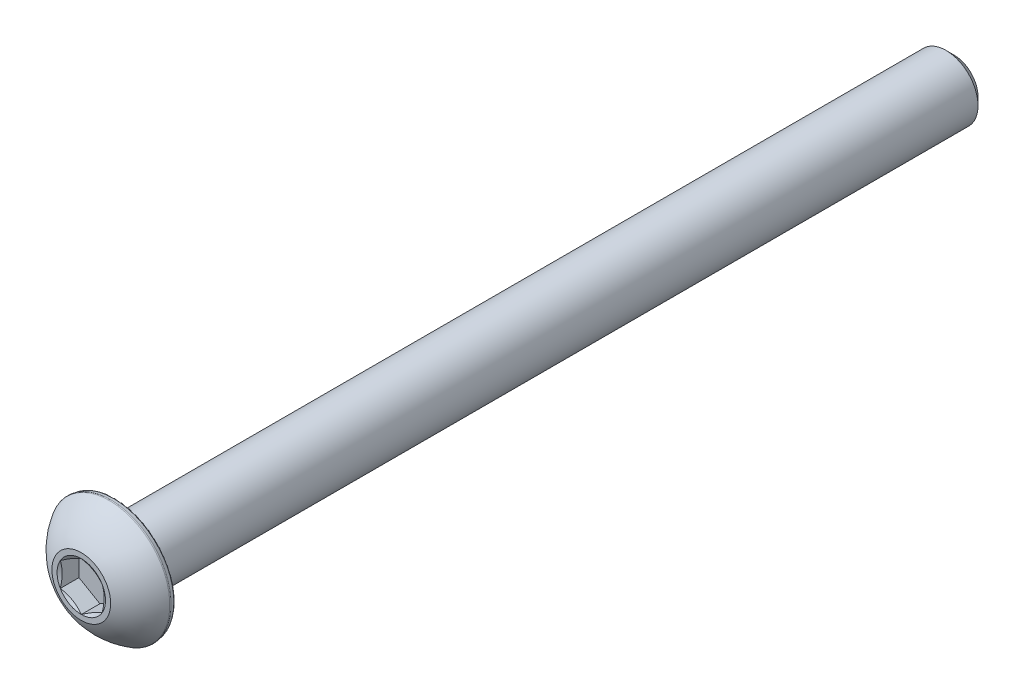
ISO-10303-21;
HEADER;
FILE_DESCRIPTION(('STEP AP214'),'2;1');
FILE_NAME('part.step','',(''),(''),'','','');
FILE_SCHEMA(('AUTOMOTIVE_DESIGN { 1 0 10303 214 1 1 1 1 }'));
ENDSEC;
DATA;
#1=APPLICATION_CONTEXT('core data for automotive mechanical design processes');
#2=APPLICATION_PROTOCOL_DEFINITION('international standard','automotive_design',2000,#1);
#3=PRODUCT_CONTEXT('',#1,'mechanical');
#4=PRODUCT('Part','Part','',(#3));
#5=PRODUCT_RELATED_PRODUCT_CATEGORY('part','',(#4));
#6=PRODUCT_DEFINITION_FORMATION('','',#4);
#7=PRODUCT_DEFINITION_CONTEXT('part definition',#1,'design');
#8=PRODUCT_DEFINITION('design','',#6,#7);
#9=PRODUCT_DEFINITION_SHAPE('','',#8);
#10=(LENGTH_UNIT() NAMED_UNIT(*) SI_UNIT(.MILLI.,.METRE.));
#11=(NAMED_UNIT(*) PLANE_ANGLE_UNIT() SI_UNIT($,.RADIAN.));
#12=(NAMED_UNIT(*) SI_UNIT($,.STERADIAN.) SOLID_ANGLE_UNIT());
#13=UNCERTAINTY_MEASURE_WITH_UNIT(LENGTH_MEASURE(1.E-05),#10,'distance_accuracy_value','');
#14=(GEOMETRIC_REPRESENTATION_CONTEXT(3) GLOBAL_UNCERTAINTY_ASSIGNED_CONTEXT((#13)) GLOBAL_UNIT_ASSIGNED_CONTEXT((#10,
#11,#12)) REPRESENTATION_CONTEXT('',''));
#15=CARTESIAN_POINT('',(0.,0.,0.));
#16=DIRECTION('',(0.,0.,1.));
#17=DIRECTION('',(1.,0.,0.));
#18=AXIS2_PLACEMENT_3D('',#15,#16,#17);
#19=CARTESIAN_POINT('',(0.,0.,33.0327));
#20=DIRECTION('',(0.,0.,-1.));
#21=DIRECTION('',(-1.,0.,0.));
#22=AXIS2_PLACEMENT_3D('',#19,#20,#21);
#23=PLANE('',#22);
#24=CARTESIAN_POINT('',(0.,0.,33.0327));
#25=DIRECTION('',(0.,0.,1.));
#26=DIRECTION('',(1.,0.,0.));
#27=AXIS2_PLACEMENT_3D('',#24,#25,#26);
#28=CIRCLE('',#27,1.83308710467706);
#29=CARTESIAN_POINT('',(-1.5875,0.916543552338533,33.0327));
#30=VERTEX_POINT('',#29);
#31=CARTESIAN_POINT('',(-1.58750000000001,-0.916543552338526,33.0327));
#32=VERTEX_POINT('',#31);
#33=EDGE_CURVE('E87',#30,#32,#28,.T.);
#34=ORIENTED_EDGE('',*,*,#33,.F.);
#35=CARTESIAN_POINT('',(0.,1.83308710467706,33.0327));
#36=VERTEX_POINT('',#35);
#37=EDGE_CURVE('E96',#36,#30,#28,.T.);
#38=ORIENTED_EDGE('',*,*,#37,.F.);
#39=CARTESIAN_POINT('',(1.5875,0.916543552338534,33.0327));
#40=VERTEX_POINT('',#39);
#41=EDGE_CURVE('E47',#40,#36,#28,.T.);
#42=ORIENTED_EDGE('',*,*,#41,.F.);
#43=CARTESIAN_POINT('',(1.58750000000001,-0.916543552338526,33.0327));
#44=VERTEX_POINT('',#43);
#45=EDGE_CURVE('E54',#44,#40,#28,.T.);
#46=ORIENTED_EDGE('',*,*,#45,.F.);
#47=CARTESIAN_POINT('',(0.,-1.83308710467706,33.0327));
#48=VERTEX_POINT('',#47);
#49=EDGE_CURVE('E129',#48,#44,#28,.T.);
#50=ORIENTED_EDGE('',*,*,#49,.F.);
#51=EDGE_CURVE('E97',#32,#48,#28,.T.);
#52=ORIENTED_EDGE('',*,*,#51,.F.);
#53=EDGE_LOOP('',(#34,#38,#42,#46,#50,#52));
#54=FACE_BOUND('',#53,.T.);
#55=CARTESIAN_POINT('',(0.,0.,33.0327));
#56=DIRECTION('',(0.,0.,1.));
#57=DIRECTION('',(1.,0.,0.));
#58=AXIS2_PLACEMENT_3D('',#55,#56,#57);
#59=CIRCLE('',#58,2.2225);
#60=CARTESIAN_POINT('',(2.2225,0.,33.0327));
#61=VERTEX_POINT('',#60);
#62=EDGE_CURVE('E108',#61,#61,#59,.T.);
#63=ORIENTED_EDGE('',*,*,#62,.T.);
#64=EDGE_LOOP('',(#63));
#65=FACE_BOUND('',#64,.T.);
#66=ADVANCED_FACE('F33',(#54,#65),#23,.F.);
#67=CARTESIAN_POINT('',(0.,0.,28.2553368578917));
#68=DIRECTION('',(0.,0.,1.));
#69=DIRECTION('',(0.,1.,0.));
#70=AXIS2_PLACEMENT_3D('',#67,#68,#69);
#71=SPHERICAL_SURFACE('',#70,5.26903262863073);
#72=CARTESIAN_POINT('',(0.,0.,30.8928886545515));
#73=DIRECTION('',(0.,0.,-1.));
#74=DIRECTION('',(-1.,0.,0.));
#75=AXIS2_PLACEMENT_3D('',#72,#73,#74);
#76=CIRCLE('',#75,4.56136222651872);
#77=CARTESIAN_POINT('',(-4.56136222651872,0.,30.8928886545515));
#78=VERTEX_POINT('',#77);
#79=EDGE_CURVE('E107',#78,#78,#76,.F.);
#80=ORIENTED_EDGE('',*,*,#79,.T.);
#81=EDGE_LOOP('',(#80));
#82=FACE_BOUND('',#81,.T.);
#83=ORIENTED_EDGE('',*,*,#62,.F.);
#84=EDGE_LOOP('',(#83));
#85=FACE_BOUND('',#84,.T.);
#86=ADVANCED_FACE('F202',(#82,#85),#71,.T.);
#87=CARTESIAN_POINT('',(0.,0.,30.4673));
#88=DIRECTION('',(0.,0.,1.));
#89=DIRECTION('',(1.,0.,0.));
#90=AXIS2_PLACEMENT_3D('',#87,#88,#89);
#91=CONICAL_SURFACE('',#90,4.51684761455358,0.174532925199433);
#92=CARTESIAN_POINT('',(0.,0.,30.8064059066341));
#93=DIRECTION('',(0.,0.,-1.));
#94=DIRECTION('',(-1.,0.,0.));
#95=AXIS2_PLACEMENT_3D('',#92,#93,#94);
#96=CIRCLE('',#95,4.57664113521079);
#97=CARTESIAN_POINT('',(-4.57664113521079,0.,30.8064059066341));
#98=VERTEX_POINT('',#97);
#99=EDGE_CURVE('E41',#98,#98,#96,.T.);
#100=ORIENTED_EDGE('',*,*,#99,.T.);
#101=EDGE_LOOP('',(#100));
#102=FACE_BOUND('',#101,.T.);
#103=CARTESIAN_POINT('',(0.,0.,30.5732961482507));
#104=DIRECTION('',(0.,0.,-1.));
#105=DIRECTION('',(-1.,0.,0.));
#106=AXIS2_PLACEMENT_3D('',#103,#104,#105);
#107=CIRCLE('',#106,4.53553759534135);
#108=CARTESIAN_POINT('',(-4.53553759534135,0.,30.5732961482507));
#109=VERTEX_POINT('',#108);
#110=EDGE_CURVE('E224',#109,#109,#107,.F.);
#111=ORIENTED_EDGE('',*,*,#110,.T.);
#112=EDGE_LOOP('',(#111));
#113=FACE_BOUND('',#112,.T.);
#114=ADVANCED_FACE('F207',(#102,#113),#91,.T.);
#115=CARTESIAN_POINT('',(0.,4.51684761455358,30.4673));
#116=DIRECTION('',(0.,0.,1.));
#117=DIRECTION('',(1.,0.,0.));
#118=AXIS2_PLACEMENT_3D('',#115,#116,#117);
#119=PLANE('',#118);
#120=CARTESIAN_POINT('',(0.,0.,30.4673));
#121=DIRECTION('',(0.,0.,1.));
#122=DIRECTION('',(1.,0.,0.));
#123=AXIS2_PLACEMENT_3D('',#120,#121,#122);
#124=CIRCLE('',#123,4.40921630486247);
#125=CARTESIAN_POINT('',(4.40921630486247,0.,30.4673));
#126=VERTEX_POINT('',#125);
#127=EDGE_CURVE('E11',#126,#126,#124,.F.);
#128=ORIENTED_EDGE('',*,*,#127,.T.);
#129=EDGE_LOOP('',(#128));
#130=FACE_BOUND('',#129,.T.);
#131=CARTESIAN_POINT('',(0.,0.,30.4673));
#132=DIRECTION('',(0.,0.,1.));
#133=DIRECTION('',(1.,0.,0.));
#134=AXIS2_PLACEMENT_3D('',#131,#132,#133);
#135=CIRCLE('',#134,2.41300000000001);
#136=CARTESIAN_POINT('',(2.41300000000001,0.,30.4673));
#137=VERTEX_POINT('',#136);
#138=EDGE_CURVE('E289',#137,#137,#135,.T.);
#139=ORIENTED_EDGE('',*,*,#138,.T.);
#140=EDGE_LOOP('',(#139));
#141=FACE_BOUND('',#140,.T.);
#142=ADVANCED_FACE('F230',(#130,#141),#119,.F.);
#143=CARTESIAN_POINT('',(0.,0.,33.0327));
#144=DIRECTION('',(0.,0.,1.));
#145=DIRECTION('',(1.,0.,0.));
#146=AXIS2_PLACEMENT_3D('',#143,#144,#145);
#147=CYLINDRICAL_SURFACE('',#146,2.41300000000001);
#148=ORIENTED_EDGE('',*,*,#138,.F.);
#149=EDGE_LOOP('',(#148));
#150=FACE_BOUND('',#149,.T.);
#151=CARTESIAN_POINT('',(0.,0.,-32.4373875));
#152=DIRECTION('',(0.,0.,1.));
#153=DIRECTION('',(1.,0.,0.));
#154=AXIS2_PLACEMENT_3D('',#151,#152,#153);
#155=CIRCLE('',#154,2.41300000000001);
#156=CARTESIAN_POINT('',(2.41300000000001,0.,-32.4373875));
#157=VERTEX_POINT('',#156);
#158=EDGE_CURVE('E286',#157,#157,#155,.T.);
#159=ORIENTED_EDGE('',*,*,#158,.T.);
#160=EDGE_LOOP('',(#159));
#161=FACE_BOUND('',#160,.T.);
#162=ADVANCED_FACE('F236',(#150,#161),#147,.T.);
#163=CARTESIAN_POINT('',(0.,0.,-33.0327));
#164=DIRECTION('',(0.,0.,1.));
#165=DIRECTION('',(1.,0.,0.));
#166=AXIS2_PLACEMENT_3D('',#163,#164,#165);
#167=CONICAL_SURFACE('',#166,1.81768750000001,0.785398163397448);
#168=ORIENTED_EDGE('',*,*,#158,.F.);
#169=EDGE_LOOP('',(#168));
#170=FACE_BOUND('',#169,.T.);
#171=CARTESIAN_POINT('',(0.,0.,-33.0327));
#172=DIRECTION('',(0.,0.,1.));
#173=DIRECTION('',(1.,0.,0.));
#174=AXIS2_PLACEMENT_3D('',#171,#172,#173);
#175=CIRCLE('',#174,1.81768750000001);
#176=CARTESIAN_POINT('',(1.81768750000001,0.,-33.0327));
#177=VERTEX_POINT('',#176);
#178=EDGE_CURVE('E274',#177,#177,#175,.T.);
#179=ORIENTED_EDGE('',*,*,#178,.T.);
#180=EDGE_LOOP('',(#179));
#181=FACE_BOUND('',#180,.T.);
#182=ADVANCED_FACE('F242',(#170,#181),#167,.T.);
#183=CARTESIAN_POINT('',(0.,0.,-33.0327));
#184=DIRECTION('',(0.,0.,1.));
#185=DIRECTION('',(1.,0.,0.));
#186=AXIS2_PLACEMENT_3D('',#183,#184,#185);
#187=PLANE('',#186);
#188=ORIENTED_EDGE('',*,*,#178,.F.);
#189=EDGE_LOOP('',(#188));
#190=FACE_BOUND('',#189,.T.);
#191=ADVANCED_FACE('F246',(#190),#187,.F.);
#192=CARTESIAN_POINT('',(0.,0.,33.0327));
#193=DIRECTION('',(0.,0.,1.));
#194=DIRECTION('',(1.,0.,0.));
#195=AXIS2_PLACEMENT_3D('',#192,#193,#194);
#196=CONICAL_SURFACE('',#195,1.83308710467706,1.0471975511966);
#197=ORIENTED_EDGE('',*,*,#51,.T.);
#198=CARTESIAN_POINT('',(-1.5877,-0.916428082284691,33.0327666729655));
#199=CARTESIAN_POINT('',(-1.51793561383713,-0.956706569415674,33.0095007862806));
#200=CARTESIAN_POINT('',(-1.44756902994941,-0.9973327355652,32.9883408437113));
#201=CARTESIAN_POINT('',(-1.30561723674211,-1.07928864158539,32.9514048800314));
#202=CARTESIAN_POINT('',(-1.23402950399672,-1.12061983835661,32.9356419273586));
#203=CARTESIAN_POINT('',(-1.09174129077364,-1.20276997656347,32.9111031289101));
#204=CARTESIAN_POINT('',(-1.02106271077293,-1.24357627375282,32.9021639893176));
#205=CARTESIAN_POINT('',(-0.879372761498721,-1.32538100410775,32.8914899780298));
#206=CARTESIAN_POINT('',(-0.808361907681014,-1.36637913967479,32.8897462700179));
#207=CARTESIAN_POINT('',(-0.675659384402059,-1.44299497721203,32.8933620228114));
#208=CARTESIAN_POINT('',(-0.6139479110751,-1.47862411294944,32.8978336901089));
#209=CARTESIAN_POINT('',(-0.490927039356861,-1.54965024635191,32.9120099071037));
#210=CARTESIAN_POINT('',(-0.429618066887653,-1.58504699811075,32.9217193055413));
#211=CARTESIAN_POINT('',(-0.306343280023913,-1.65621972949082,32.9459934889126));
#212=CARTESIAN_POINT('',(-0.244393078468155,-1.69198669503539,32.9606612337072));
#213=CARTESIAN_POINT('',(-0.121416971719016,-1.7629869833709,32.9939517983435));
#214=CARTESIAN_POINT('',(-0.0603894894127828,-1.79822121670836,33.0125667893901));
#215=CARTESIAN_POINT('',(0.000200000000000892,-1.8332025747309,33.0327666729655));
#216=B_SPLINE_CURVE_WITH_KNOTS('',3,(#198,#199,#200,#201,#202,#203,#204,#205,#206,#207,#208,
#209,#210,#211,#212,#213,#214,#215),.UNSPECIFIED.,.F.,.F.,(4,2,2,2,2,2,2,2,4),(0.,
0.251647272601205,0.503899652171033,0.749908024753695,0.995614197816256,1.20960574360963,
1.42379572923035,1.64273857632786,1.86125117688001),.UNSPECIFIED.);
#217=EDGE_CURVE('E102',#32,#48,#216,.T.);
#218=ORIENTED_EDGE('',*,*,#217,.F.);
#219=EDGE_LOOP('',(#197,#218));
#220=FACE_BOUND('',#219,.T.);
#221=ADVANCED_FACE('F103',(#220),#196,.F.);
#222=ORIENTED_EDGE('',*,*,#49,.T.);
#223=CARTESIAN_POINT('',(-0.000199999999999989,-1.8332025747309,33.0327666729655));
#224=CARTESIAN_POINT('',(0.0695643861628727,-1.79292408759991,33.0095007862806));
#225=CARTESIAN_POINT('',(0.139930970050586,-1.75229792145039,32.9883408437113));
#226=CARTESIAN_POINT('',(0.281882763257892,-1.6703420154302,32.9514048800314));
#227=CARTESIAN_POINT('',(0.353470496003282,-1.62901081865897,32.9356419273586));
#228=CARTESIAN_POINT('',(0.495758709226359,-1.54686068045212,32.9111031289101));
#229=CARTESIAN_POINT('',(0.566437289227069,-1.50605438326277,32.9021639893176));
#230=CARTESIAN_POINT('',(0.708127238501278,-1.42424965290784,32.8914899780298));
#231=CARTESIAN_POINT('',(0.779138092318984,-1.3832515173408,32.8897462700179));
#232=CARTESIAN_POINT('',(0.911840615597939,-1.30663567980355,32.8933620228114));
#233=CARTESIAN_POINT('',(0.973552088924898,-1.27100654406615,32.8978336901089));
#234=CARTESIAN_POINT('',(1.09657296064314,-1.19998041066368,32.9120099071037));
#235=CARTESIAN_POINT('',(1.15788193311235,-1.16458365890484,32.9217193055413));
#236=CARTESIAN_POINT('',(1.28115671997609,-1.09341092752477,32.9459934889126));
#237=CARTESIAN_POINT('',(1.34310692153184,-1.0576439619802,32.9606612337072));
#238=CARTESIAN_POINT('',(1.46608302828098,-0.986643673644692,32.9939517983435));
#239=CARTESIAN_POINT('',(1.52711051058722,-0.951409440307223,33.0125667893901));
#240=CARTESIAN_POINT('',(1.5877,-0.91642808228469,33.0327666729655));
#241=B_SPLINE_CURVE_WITH_KNOTS('',3,(#223,#224,#225,#226,#227,#228,#229,#230,#231,#232,#233,
#234,#235,#236,#237,#238,#239,#240),.UNSPECIFIED.,.F.,.F.,(4,2,2,2,2,2,2,2,4),(0.,
0.251647272601204,0.503899652171032,0.749908024753693,0.995614197816254,1.20960574360963,
1.42379572923035,1.64273857632785,1.86125117688),.UNSPECIFIED.);
#242=EDGE_CURVE('E131',#48,#44,#241,.T.);
#243=ORIENTED_EDGE('',*,*,#242,.F.);
#244=EDGE_LOOP('',(#222,#243));
#245=FACE_BOUND('',#244,.T.);
#246=ADVANCED_FACE('F315',(#245),#196,.F.);
#247=ORIENTED_EDGE('',*,*,#45,.T.);
#248=CARTESIAN_POINT('',(1.5875,-2.37354288027605,33.6229885208739));
#249=CARTESIAN_POINT('',(1.5875,-2.30498906897406,33.5900989849401));
#250=CARTESIAN_POINT('',(1.5875,-2.23626839223786,33.5575511500262));
#251=CARTESIAN_POINT('',(1.5875,-2.09840401641783,33.4933325063193));
#252=CARTESIAN_POINT('',(1.5875,-2.02926024390265,33.4616618553611));
#253=CARTESIAN_POINT('',(1.5875,-1.89006393379529,33.3992142743397));
#254=CARTESIAN_POINT('',(1.5875,-1.82000842787054,33.3684439309972));
#255=CARTESIAN_POINT('',(1.5875,-1.6793106951035,33.3082837403263));
#256=CARTESIAN_POINT('',(1.5875,-1.60866849899343,33.278893821218));
#257=CARTESIAN_POINT('',(1.5875,-1.46481905678083,33.2211103594079));
#258=CARTESIAN_POINT('',(1.5875,-1.39159303106009,33.1927629463599));
#259=CARTESIAN_POINT('',(1.5875,-1.24427117679401,33.1384344562192));
#260=CARTESIAN_POINT('',(1.5875,-1.17017524056602,33.1124536756443));
#261=CARTESIAN_POINT('',(1.5875,-0.946703117236296,33.0391569820684));
#262=CARTESIAN_POINT('',(1.5875,-0.795733661821906,32.9963147731057));
#263=CARTESIAN_POINT('',(1.5875,-0.566258816268268,32.9466199166704));
#264=CARTESIAN_POINT('',(1.5875,-0.489336969230921,32.9324894569834));
#265=CARTESIAN_POINT('',(1.5875,-0.334627971891012,32.9100533723758));
#266=CARTESIAN_POINT('',(1.5875,-0.256840880424314,32.9017473538284));
#267=CARTESIAN_POINT('',(1.5875,-0.101768207486038,32.8917284519227));
#268=CARTESIAN_POINT('',(1.5875,-0.0244877840878056,32.8899377648977));
#269=CARTESIAN_POINT('',(1.5875,0.129945425556553,32.892893558617));
#270=CARTESIAN_POINT('',(1.5875,0.207098203603202,32.8976404441443));
#271=CARTESIAN_POINT('',(1.5875,0.397461231176442,32.9170004956614));
#272=CARTESIAN_POINT('',(1.5875,0.510302581730163,32.9352417856813));
#273=CARTESIAN_POINT('',(1.5875,0.733790948294141,32.9822808093857));
#274=CARTESIAN_POINT('',(1.5875,0.844435149473764,33.0110912661176));
#275=CARTESIAN_POINT('',(1.5875,1.00991571828403,33.0603065665647));
#276=CARTESIAN_POINT('',(1.5875,1.06560747491338,33.0779411407527));
#277=CARTESIAN_POINT('',(1.5875,1.17641127317169,33.1148415882282));
#278=CARTESIAN_POINT('',(1.5875,1.23152365277664,33.1341064434591));
#279=CARTESIAN_POINT('',(1.5875,1.34124234685352,33.1739876706602));
#280=CARTESIAN_POINT('',(1.5875,1.39584875124713,33.194603797013));
#281=CARTESIAN_POINT('',(1.5875,1.50463128017381,33.2369645699702));
#282=CARTESIAN_POINT('',(1.5875,1.55880733021518,33.2587094072426));
#283=CARTESIAN_POINT('',(1.5875,1.69709397430046,33.3156069484812));
#284=CARTESIAN_POINT('',(1.5875,1.78092805766898,33.351430979497));
#285=CARTESIAN_POINT('',(1.5875,1.94783917261493,33.4248059677321));
#286=CARTESIAN_POINT('',(1.5875,2.03091614691811,33.4623570543227));
#287=CARTESIAN_POINT('',(1.5875,2.27926367299453,33.5769920906548));
#288=CARTESIAN_POINT('',(1.5875,2.44362308741276,33.6560460645935));
#289=CARTESIAN_POINT('',(1.5875,2.77093773989402,33.8174695225969));
#290=CARTESIAN_POINT('',(1.5875,2.93389100335285,33.899842963081));
#291=CARTESIAN_POINT('',(1.5875,3.25868106672949,34.0667079304629));
#292=CARTESIAN_POINT('',(1.5875,3.42051800525884,34.1511991881315));
#293=CARTESIAN_POINT('',(1.5875,3.72818042196343,34.3135970323093));
#294=CARTESIAN_POINT('',(1.5875,3.8740753985625,34.3913724110238));
#295=CARTESIAN_POINT('',(1.5875,4.16539605096666,34.5478093386262));
#296=CARTESIAN_POINT('',(1.5875,4.31082170914627,34.6264709203089));
#297=CARTESIAN_POINT('',(1.5875,4.60094201771576,34.7842570957874));
#298=CARTESIAN_POINT('',(1.5875,4.74563758660809,34.8633800029954));
#299=CARTESIAN_POINT('',(1.5875,5.03473618489941,35.0221407922694));
#300=CARTESIAN_POINT('',(1.5875,5.1791392292114,35.1017786471689));
#301=CARTESIAN_POINT('',(1.5875,5.32343717609416,35.1816053345252));
#302=B_SPLINE_CURVE_WITH_KNOTS('',3,(#248,#249,#250,#251,#252,#253,#254,#255,#256,#257,#258,
#259,#260,#261,#262,#263,#264,#265,#266,#267,#268,#269,#270,#271,#272,#273,#274,#275,#276,#277,
#278,#279,#280,#281,#282,#283,#284,#285,#286,#287,#288,#289,#290,#291,#292,#293,#294,#295,#296,
#297,#298,#299,#300,#301),.UNSPECIFIED.,.F.,.F.,(4,2,2,2,2,2,2,2,2,2,2,2,2,2,2,2,2,2,2,2,2,2,2,
2,2,2,4),(0.,0.228108416316538,0.456257613800002,0.685790772408023,0.915311982421996,
1.15083308117179,1.38638364812083,1.85615598568851,2.09060484106677,2.32503785042029,
2.55666198604243,2.78830046363685,3.13051568227743,3.47314421494376,3.6483760219735,
3.82349919880257,3.99859063171139,4.17371173887894,4.44718606585055,4.72068091184658,
5.267760937063,5.8155135100862,6.3631967992846,6.85918646152393,7.35519453905289,
7.84994100628723,8.34466158226601),.UNSPECIFIED.);
#303=EDGE_CURVE('E140',#44,#40,#302,.T.);
#304=ORIENTED_EDGE('',*,*,#303,.F.);
#305=EDGE_LOOP('',(#247,#304));
#306=FACE_BOUND('',#305,.T.);
#307=ADVANCED_FACE('F311',(#306),#196,.F.);
#308=ORIENTED_EDGE('',*,*,#41,.T.);
#309=CARTESIAN_POINT('',(1.5877,0.916428082284696,33.0327666729655));
#310=CARTESIAN_POINT('',(1.51793561383713,0.956706569415679,33.0095007862806));
#311=CARTESIAN_POINT('',(1.44756902994941,0.997332735565205,32.9883408437113));
#312=CARTESIAN_POINT('',(1.30561723674211,1.07928864158539,32.9514048800314));
#313=CARTESIAN_POINT('',(1.23402950399672,1.12061983835662,32.9356419273586));
#314=CARTESIAN_POINT('',(1.09174129077364,1.20276997656347,32.9111031289101));
#315=CARTESIAN_POINT('',(1.02106271077293,1.24357627375282,32.9021639893176));
#316=CARTESIAN_POINT('',(0.879372761498721,1.32538100410775,32.8914899780298));
#317=CARTESIAN_POINT('',(0.808361907681014,1.36637913967479,32.8897462700179));
#318=CARTESIAN_POINT('',(0.675659384402059,1.44299497721204,32.8933620228114));
#319=CARTESIAN_POINT('',(0.6139479110751,1.47862411294945,32.8978336901089));
#320=CARTESIAN_POINT('',(0.49092703935686,1.54965024635191,32.9120099071037));
#321=CARTESIAN_POINT('',(0.429618066887651,1.58504699811075,32.9217193055413));
#322=CARTESIAN_POINT('',(0.306343280023911,1.65621972949083,32.9459934889126));
#323=CARTESIAN_POINT('',(0.244393078468154,1.69198669503539,32.9606612337072));
#324=CARTESIAN_POINT('',(0.121416971719015,1.7629869833709,32.9939517983435));
#325=CARTESIAN_POINT('',(0.0603894894127826,1.79822121670837,33.0125667893901));
#326=CARTESIAN_POINT('',(-0.000200000000000941,1.8332025747309,33.0327666729655));
#327=B_SPLINE_CURVE_WITH_KNOTS('',3,(#309,#310,#311,#312,#313,#314,#315,#316,#317,#318,#319,
#320,#321,#322,#323,#324,#325,#326),.UNSPECIFIED.,.F.,.F.,(4,2,2,2,2,2,2,2,4),(0.,
0.251647272601206,0.503899652171031,0.749908024753694,0.995614197816256,1.20960574360963,
1.42379572923035,1.64273857632786,1.86125117688),.UNSPECIFIED.);
#328=EDGE_CURVE('E167',#40,#36,#327,.T.);
#329=ORIENTED_EDGE('',*,*,#328,.F.);
#330=EDGE_LOOP('',(#308,#329));
#331=FACE_BOUND('',#330,.T.);
#332=ADVANCED_FACE('F307',(#331),#196,.F.);
#333=ORIENTED_EDGE('',*,*,#37,.T.);
#334=CARTESIAN_POINT('',(0.0001999999999988,1.8332025747309,33.0327666729655));
#335=CARTESIAN_POINT('',(-0.0695643861628735,1.79292408759992,33.0095007862806));
#336=CARTESIAN_POINT('',(-0.139930970050587,1.75229792145039,32.9883408437113));
#337=CARTESIAN_POINT('',(-0.281882763257895,1.6703420154302,32.9514048800314));
#338=CARTESIAN_POINT('',(-0.353470496003284,1.62901081865898,32.9356419273586));
#339=CARTESIAN_POINT('',(-0.495758709226361,1.54686068045212,32.9111031289101));
#340=CARTESIAN_POINT('',(-0.566437289227071,1.50605438326277,32.9021639893176));
#341=CARTESIAN_POINT('',(-0.708127238501281,1.42424965290784,32.8914899780298));
#342=CARTESIAN_POINT('',(-0.779138092318987,1.38325151734081,32.8897462700179));
#343=CARTESIAN_POINT('',(-0.911840615597943,1.30663567980356,32.8933620228114));
#344=CARTESIAN_POINT('',(-0.973552088924902,1.27100654406615,32.8978336901089));
#345=CARTESIAN_POINT('',(-1.09657296064314,1.19998041066368,32.9120099071037));
#346=CARTESIAN_POINT('',(-1.15788193311235,1.16458365890485,32.9217193055413));
#347=CARTESIAN_POINT('',(-1.28115671997609,1.09341092752477,32.9459934889126));
#348=CARTESIAN_POINT('',(-1.34310692153185,1.0576439619802,32.9606612337072));
#349=CARTESIAN_POINT('',(-1.46608302828098,0.986643673644696,32.9939517983435));
#350=CARTESIAN_POINT('',(-1.52711051058722,0.951409440307228,33.0125667893901));
#351=CARTESIAN_POINT('',(-1.5877,0.916428082284696,33.0327666729655));
#352=B_SPLINE_CURVE_WITH_KNOTS('',3,(#334,#335,#336,#337,#338,#339,#340,#341,#342,#343,#344,
#345,#346,#347,#348,#349,#350,#351),.UNSPECIFIED.,.F.,.F.,(4,2,2,2,2,2,2,2,4),(0.,
0.251647272601206,0.503899652171031,0.749908024753695,0.995614197816256,1.20960574360963,
1.42379572923035,1.64273857632785,1.86125117688),.UNSPECIFIED.);
#353=EDGE_CURVE('E118',#36,#30,#352,.T.);
#354=ORIENTED_EDGE('',*,*,#353,.F.);
#355=EDGE_LOOP('',(#333,#354));
#356=FACE_BOUND('',#355,.T.);
#357=ADVANCED_FACE('F154',(#356),#196,.F.);
#358=ORIENTED_EDGE('',*,*,#33,.T.);
#359=CARTESIAN_POINT('',(-1.5875,-2.37354288027605,33.6229885208739));
#360=CARTESIAN_POINT('',(-1.5875,-2.30498906897406,33.5900989849401));
#361=CARTESIAN_POINT('',(-1.5875,-2.23626839223786,33.5575511500262));
#362=CARTESIAN_POINT('',(-1.5875,-2.09840401641783,33.4933325063193));
#363=CARTESIAN_POINT('',(-1.5875,-2.02926024390265,33.4616618553611));
#364=CARTESIAN_POINT('',(-1.5875,-1.89006393379529,33.3992142743397));
#365=CARTESIAN_POINT('',(-1.5875,-1.82000842787054,33.3684439309972));
#366=CARTESIAN_POINT('',(-1.5875,-1.6793106951035,33.3082837403263));
#367=CARTESIAN_POINT('',(-1.5875,-1.60866849899343,33.278893821218));
#368=CARTESIAN_POINT('',(-1.5875,-1.46481905678083,33.2211103594079));
#369=CARTESIAN_POINT('',(-1.5875,-1.39159303106009,33.1927629463599));
#370=CARTESIAN_POINT('',(-1.5875,-1.24427117679401,33.1384344562192));
#371=CARTESIAN_POINT('',(-1.5875,-1.17017524056602,33.1124536756443));
#372=CARTESIAN_POINT('',(-1.5875,-0.946703117236297,33.0391569820684));
#373=CARTESIAN_POINT('',(-1.5875,-0.795733661821907,32.9963147731057));
#374=CARTESIAN_POINT('',(-1.5875,-0.566258816268268,32.9466199166704));
#375=CARTESIAN_POINT('',(-1.5875,-0.489336969230921,32.9324894569834));
#376=CARTESIAN_POINT('',(-1.5875,-0.334627971891012,32.9100533723758));
#377=CARTESIAN_POINT('',(-1.5875,-0.256840880424313,32.9017473538284));
#378=CARTESIAN_POINT('',(-1.5875,-0.101768207486037,32.8917284519227));
#379=CARTESIAN_POINT('',(-1.5875,-0.0244877840878046,32.8899377648977));
#380=CARTESIAN_POINT('',(-1.5875,0.129945425556554,32.892893558617));
#381=CARTESIAN_POINT('',(-1.5875,0.207098203603204,32.8976404441443));
#382=CARTESIAN_POINT('',(-1.5875,0.397461231176443,32.9170004956614));
#383=CARTESIAN_POINT('',(-1.5875,0.510302581730164,32.9352417856813));
#384=CARTESIAN_POINT('',(-1.5875,0.733790948294142,32.9822808093857));
#385=CARTESIAN_POINT('',(-1.5875,0.844435149473765,33.0110912661176));
#386=CARTESIAN_POINT('',(-1.5875,1.00991571828403,33.0603065665647));
#387=CARTESIAN_POINT('',(-1.5875,1.06560747491338,33.0779411407527));
#388=CARTESIAN_POINT('',(-1.5875,1.17641127317169,33.1148415882282));
#389=CARTESIAN_POINT('',(-1.5875,1.23152365277664,33.1341064434591));
#390=CARTESIAN_POINT('',(-1.5875,1.34124234685352,33.1739876706602));
#391=CARTESIAN_POINT('',(-1.5875,1.39584875124713,33.194603797013));
#392=CARTESIAN_POINT('',(-1.5875,1.50463128017381,33.2369645699702));
#393=CARTESIAN_POINT('',(-1.5875,1.55880733021518,33.2587094072426));
#394=CARTESIAN_POINT('',(-1.5875,1.69709397430046,33.3156069484812));
#395=CARTESIAN_POINT('',(-1.5875,1.78092805766898,33.351430979497));
#396=CARTESIAN_POINT('',(-1.5875,1.94783917261493,33.4248059677321));
#397=CARTESIAN_POINT('',(-1.5875,2.03091614691811,33.4623570543227));
#398=CARTESIAN_POINT('',(-1.5875,2.27926367299453,33.5769920906548));
#399=CARTESIAN_POINT('',(-1.5875,2.44362308741276,33.6560460645935));
#400=CARTESIAN_POINT('',(-1.5875,2.77093773989403,33.8174695225969));
#401=CARTESIAN_POINT('',(-1.5875,2.93389100335285,33.899842963081));
#402=CARTESIAN_POINT('',(-1.5875,3.2586810667295,34.0667079304629));
#403=CARTESIAN_POINT('',(-1.5875,3.42051800525885,34.1511991881315));
#404=CARTESIAN_POINT('',(-1.5875,3.72818042196343,34.3135970323093));
#405=CARTESIAN_POINT('',(-1.5875,3.8740753985625,34.3913724110238));
#406=CARTESIAN_POINT('',(-1.5875,4.16539605096666,34.5478093386262));
#407=CARTESIAN_POINT('',(-1.5875,4.31082170914627,34.6264709203089));
#408=CARTESIAN_POINT('',(-1.5875,4.60094201771576,34.7842570957874));
#409=CARTESIAN_POINT('',(-1.5875,4.74563758660809,34.8633800029954));
#410=CARTESIAN_POINT('',(-1.5875,5.03473618489941,35.0221407922694));
#411=CARTESIAN_POINT('',(-1.5875,5.1791392292114,35.1017786471689));
#412=CARTESIAN_POINT('',(-1.5875,5.32343717609416,35.1816053345252));
#413=B_SPLINE_CURVE_WITH_KNOTS('',3,(#359,#360,#361,#362,#363,#364,#365,#366,#367,#368,#369,
#370,#371,#372,#373,#374,#375,#376,#377,#378,#379,#380,#381,#382,#383,#384,#385,#386,#387,#388,
#389,#390,#391,#392,#393,#394,#395,#396,#397,#398,#399,#400,#401,#402,#403,#404,#405,#406,#407,
#408,#409,#410,#411,#412),.UNSPECIFIED.,.F.,.F.,(4,2,2,2,2,2,2,2,2,2,2,2,2,2,2,2,2,2,2,2,2,2,2,
2,2,2,4),(0.,0.228108416316537,0.456257613800002,0.685790772408022,0.915311982421995,
1.15083308117179,1.38638364812082,1.85615598568851,2.09060484106677,2.32503785042029,
2.55666198604243,2.78830046363685,3.13051568227743,3.47314421494376,3.6483760219735,
3.82349919880256,3.99859063171139,4.17371173887894,4.44718606585054,4.72068091184658,
5.267760937063,5.8155135100862,6.3631967992846,6.85918646152392,7.35519453905289,
7.84994100628722,8.344661582266),.UNSPECIFIED.);
#414=EDGE_CURVE('E91',#30,#32,#413,.F.);
#415=ORIENTED_EDGE('',*,*,#414,.F.);
#416=EDGE_LOOP('',(#358,#415));
#417=FACE_BOUND('',#416,.T.);
#418=ADVANCED_FACE('F89',(#417),#196,.F.);
#419=CARTESIAN_POINT('',(0.,0.,31.62173));
#420=DIRECTION('',(0.,0.,1.));
#421=DIRECTION('',(1.,0.,0.));
#422=AXIS2_PLACEMENT_3D('',#419,#420,#421);
#423=PLANE('',#422);
#424=DIRECTION('',(0.,-1.,0.));
#425=VECTOR('',#424,1.);
#426=CARTESIAN_POINT('',(-1.5875,0.916543552338533,31.62173));
#427=LINE('',#426,#425);
#428=CARTESIAN_POINT('',(-1.5875,0.916543552338533,31.62173));
#429=VERTEX_POINT('',#428);
#430=CARTESIAN_POINT('',(-1.5875,-0.916543552338528,31.62173));
#431=VERTEX_POINT('',#430);
#432=EDGE_CURVE('E117',#429,#431,#427,.T.);
#433=ORIENTED_EDGE('',*,*,#432,.T.);
#434=DIRECTION('',(0.866025403784439,-0.5,0.));
#435=VECTOR('',#434,1.);
#436=CARTESIAN_POINT('',(-1.5875,-0.916543552338528,31.62173));
#437=LINE('',#436,#435);
#438=CARTESIAN_POINT('',(0.,-1.83308710467706,31.62173));
#439=VERTEX_POINT('',#438);
#440=EDGE_CURVE('E122',#431,#439,#437,.T.);
#441=ORIENTED_EDGE('',*,*,#440,.T.);
#442=DIRECTION('',(0.866025403784439,0.5,0.));
#443=VECTOR('',#442,1.);
#444=CARTESIAN_POINT('',(0.,-1.83308710467706,31.62173));
#445=LINE('',#444,#443);
#446=CARTESIAN_POINT('',(1.5875,-0.916543552338528,31.62173));
#447=VERTEX_POINT('',#446);
#448=EDGE_CURVE('E263',#439,#447,#445,.T.);
#449=ORIENTED_EDGE('',*,*,#448,.T.);
#450=DIRECTION('',(0.,1.,0.));
#451=VECTOR('',#450,1.);
#452=CARTESIAN_POINT('',(1.5875,-0.916543552338528,31.62173));
#453=LINE('',#452,#451);
#454=CARTESIAN_POINT('',(1.5875,0.916543552338534,31.62173));
#455=VERTEX_POINT('',#454);
#456=EDGE_CURVE('E267',#447,#455,#453,.T.);
#457=ORIENTED_EDGE('',*,*,#456,.T.);
#458=DIRECTION('',(-0.866025403784439,0.5,0.));
#459=VECTOR('',#458,1.);
#460=CARTESIAN_POINT('',(1.5875,0.916543552338534,31.62173));
#461=LINE('',#460,#459);
#462=CARTESIAN_POINT('',(0.,1.83308710467706,31.62173));
#463=VERTEX_POINT('',#462);
#464=EDGE_CURVE('E270',#455,#463,#461,.T.);
#465=ORIENTED_EDGE('',*,*,#464,.T.);
#466=DIRECTION('',(-0.866025403784439,-0.5,0.));
#467=VECTOR('',#466,1.);
#468=CARTESIAN_POINT('',(0.,1.83308710467706,31.62173));
#469=LINE('',#468,#467);
#470=EDGE_CURVE('E125',#463,#429,#469,.T.);
#471=ORIENTED_EDGE('',*,*,#470,.T.);
#472=EDGE_LOOP('',(#433,#441,#449,#457,#465,#471));
#473=FACE_BOUND('',#472,.T.);
#474=ADVANCED_FACE('F153',(#473),#423,.T.);
#475=CARTESIAN_POINT('',(-1.5875,-0.916543552338528,31.62173));
#476=DIRECTION('',(-0.5,-0.866025403784439,0.));
#477=DIRECTION('',(0.866025403784439,-0.5,0.));
#478=AXIS2_PLACEMENT_3D('',#475,#476,#477);
#479=PLANE('',#478);
#480=DIRECTION('',(0.,0.,1.));
#481=VECTOR('',#480,1.);
#482=CARTESIAN_POINT('',(-1.5875,-0.916543552338528,31.62173));
#483=LINE('',#482,#481);
#484=EDGE_CURVE('E113',#431,#32,#483,.T.);
#485=ORIENTED_EDGE('',*,*,#484,.T.);
#486=ORIENTED_EDGE('',*,*,#217,.T.);
#487=DIRECTION('',(0.,0.,1.));
#488=VECTOR('',#487,1.);
#489=CARTESIAN_POINT('',(0.,-1.83308710467706,31.62173));
#490=LINE('',#489,#488);
#491=EDGE_CURVE('E124',#439,#48,#490,.T.);
#492=ORIENTED_EDGE('',*,*,#491,.F.);
#493=ORIENTED_EDGE('',*,*,#440,.F.);
#494=EDGE_LOOP('',(#485,#486,#492,#493));
#495=FACE_BOUND('',#494,.T.);
#496=ADVANCED_FACE('F120',(#495),#479,.F.);
#497=CARTESIAN_POINT('',(0.,-1.83308710467706,31.62173));
#498=DIRECTION('',(0.5,-0.866025403784439,0.));
#499=DIRECTION('',(0.866025403784439,0.5,0.));
#500=AXIS2_PLACEMENT_3D('',#497,#498,#499);
#501=PLANE('',#500);
#502=ORIENTED_EDGE('',*,*,#491,.T.);
#503=ORIENTED_EDGE('',*,*,#242,.T.);
#504=DIRECTION('',(0.,0.,1.));
#505=VECTOR('',#504,1.);
#506=CARTESIAN_POINT('',(1.5875,-0.916543552338528,31.62173));
#507=LINE('',#506,#505);
#508=EDGE_CURVE('E281',#447,#44,#507,.T.);
#509=ORIENTED_EDGE('',*,*,#508,.F.);
#510=ORIENTED_EDGE('',*,*,#448,.F.);
#511=EDGE_LOOP('',(#502,#503,#509,#510));
#512=FACE_BOUND('',#511,.T.);
#513=ADVANCED_FACE('F147',(#512),#501,.F.);
#514=CARTESIAN_POINT('',(1.5875,-0.916543552338528,31.62173));
#515=DIRECTION('',(1.,0.,0.));
#516=DIRECTION('',(0.,1.,0.));
#517=AXIS2_PLACEMENT_3D('',#514,#515,#516);
#518=PLANE('',#517);
#519=ORIENTED_EDGE('',*,*,#508,.T.);
#520=ORIENTED_EDGE('',*,*,#303,.T.);
#521=DIRECTION('',(0.,0.,1.));
#522=VECTOR('',#521,1.);
#523=CARTESIAN_POINT('',(1.5875,0.916543552338534,31.62173));
#524=LINE('',#523,#522);
#525=EDGE_CURVE('E278',#455,#40,#524,.T.);
#526=ORIENTED_EDGE('',*,*,#525,.F.);
#527=ORIENTED_EDGE('',*,*,#456,.F.);
#528=EDGE_LOOP('',(#519,#520,#526,#527));
#529=FACE_BOUND('',#528,.T.);
#530=ADVANCED_FACE('F191',(#529),#518,.F.);
#531=CARTESIAN_POINT('',(1.5875,0.916543552338534,31.62173));
#532=DIRECTION('',(0.499999999999999,0.866025403784439,0.));
#533=DIRECTION('',(-0.866025403784439,0.5,0.));
#534=AXIS2_PLACEMENT_3D('',#531,#532,#533);
#535=PLANE('',#534);
#536=ORIENTED_EDGE('',*,*,#525,.T.);
#537=ORIENTED_EDGE('',*,*,#328,.T.);
#538=DIRECTION('',(0.,0.,1.));
#539=VECTOR('',#538,1.);
#540=CARTESIAN_POINT('',(0.,1.83308710467706,31.62173));
#541=LINE('',#540,#539);
#542=EDGE_CURVE('E275',#463,#36,#541,.T.);
#543=ORIENTED_EDGE('',*,*,#542,.F.);
#544=ORIENTED_EDGE('',*,*,#464,.F.);
#545=EDGE_LOOP('',(#536,#537,#543,#544));
#546=FACE_BOUND('',#545,.T.);
#547=ADVANCED_FACE('F187',(#546),#535,.F.);
#548=CARTESIAN_POINT('',(0.,1.83308710467706,31.62173));
#549=DIRECTION('',(-0.5,0.866025403784438,0.));
#550=DIRECTION('',(-0.866025403784439,-0.5,0.));
#551=AXIS2_PLACEMENT_3D('',#548,#549,#550);
#552=PLANE('',#551);
#553=ORIENTED_EDGE('',*,*,#542,.T.);
#554=ORIENTED_EDGE('',*,*,#353,.T.);
#555=DIRECTION('',(0.,0.,1.));
#556=VECTOR('',#555,1.);
#557=CARTESIAN_POINT('',(-1.5875,0.916543552338533,31.62173));
#558=LINE('',#557,#556);
#559=EDGE_CURVE('E115',#429,#30,#558,.T.);
#560=ORIENTED_EDGE('',*,*,#559,.F.);
#561=ORIENTED_EDGE('',*,*,#470,.F.);
#562=EDGE_LOOP('',(#553,#554,#560,#561));
#563=FACE_BOUND('',#562,.T.);
#564=ADVANCED_FACE('F184',(#563),#552,.F.);
#565=CARTESIAN_POINT('',(-1.5875,0.916543552338533,31.62173));
#566=DIRECTION('',(-1.,0.,0.));
#567=DIRECTION('',(0.,0.,1.));
#568=AXIS2_PLACEMENT_3D('',#565,#566,#567);
#569=PLANE('',#568);
#570=ORIENTED_EDGE('',*,*,#559,.T.);
#571=ORIENTED_EDGE('',*,*,#414,.T.);
#572=ORIENTED_EDGE('',*,*,#484,.F.);
#573=ORIENTED_EDGE('',*,*,#432,.F.);
#574=EDGE_LOOP('',(#570,#571,#572,#573));
#575=FACE_BOUND('',#574,.T.);
#576=ADVANCED_FACE('F111',(#575),#569,.F.);
#577=CARTESIAN_POINT('',(0.,0.,30.8286797583835));
#578=DIRECTION('',(0.,0.,-1.));
#579=DIRECTION('',(-1.,0.,0.));
#580=AXIS2_PLACEMENT_3D('',#577,#578,#579);
#581=TOROIDAL_SURFACE('',#580,4.45031984473191,0.12827);
#582=ORIENTED_EDGE('',*,*,#99,.F.);
#583=EDGE_LOOP('',(#582));
#584=FACE_BOUND('',#583,.T.);
#585=ORIENTED_EDGE('',*,*,#79,.F.);
#586=EDGE_LOOP('',(#585));
#587=FACE_BOUND('',#586,.T.);
#588=ADVANCED_FACE('F211',(#584,#587),#581,.T.);
#589=CARTESIAN_POINT('',(0.,0.,30.59557));
#590=DIRECTION('',(0.,0.,1.));
#591=DIRECTION('',(1.,0.,0.));
#592=AXIS2_PLACEMENT_3D('',#589,#590,#591);
#593=TOROIDAL_SURFACE('',#592,4.40921630486247,0.12827);
#594=ORIENTED_EDGE('',*,*,#127,.F.);
#595=EDGE_LOOP('',(#594));
#596=FACE_BOUND('',#595,.T.);
#597=ORIENTED_EDGE('',*,*,#110,.F.);
#598=EDGE_LOOP('',(#597));
#599=FACE_BOUND('',#598,.T.);
#600=ADVANCED_FACE('F35',(#596,#599),#593,.T.);
#601=CLOSED_SHELL('',(#66,#86,#114,#142,#162,#182,#191,#221,#246,#307,#332,#357,#418,#474,#496,
#513,#530,#547,#564,#576,#588,#600));
#602=MANIFOLD_SOLID_BREP('B2',#601);
#603=ADVANCED_BREP_SHAPE_REPRESENTATION('',(#18,#602),#14);
#604=SHAPE_DEFINITION_REPRESENTATION(#9,#603);
ENDSEC;
END-ISO-10303-21;
